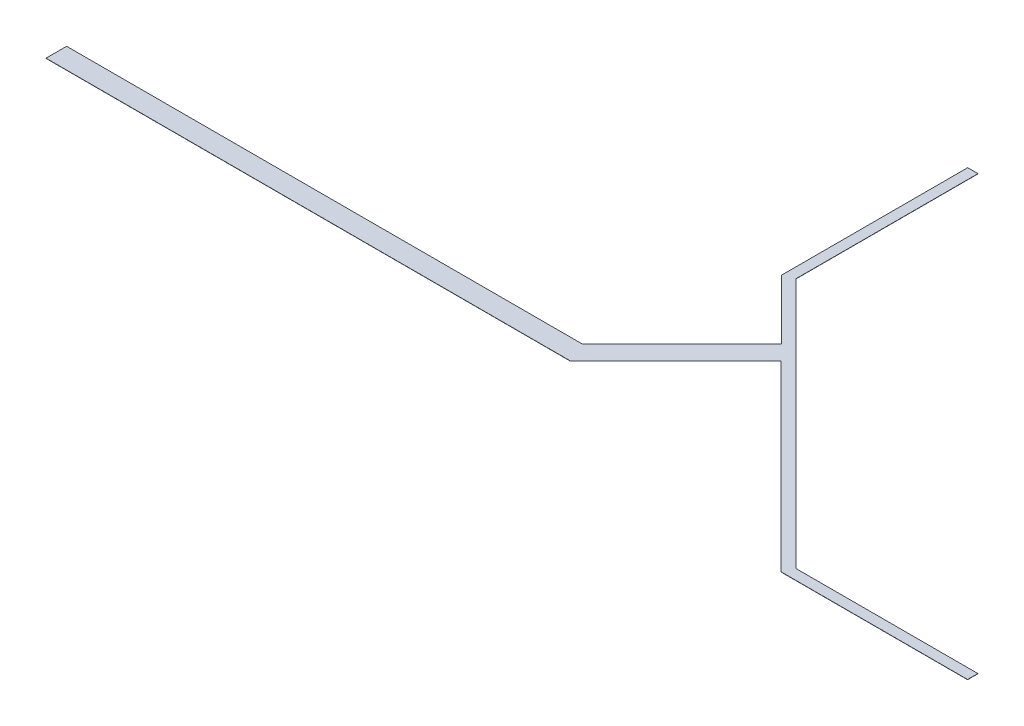
ISO-10303-21;
HEADER;
FILE_DESCRIPTION(('STEP AP214'),'2;1');
FILE_NAME('part.step','',(''),(''),'','','');
FILE_SCHEMA(('AUTOMOTIVE_DESIGN { 1 0 10303 214 1 1 1 1 }'));
ENDSEC;
DATA;
#1=APPLICATION_CONTEXT('core data for automotive mechanical design processes');
#2=APPLICATION_PROTOCOL_DEFINITION('international standard','automotive_design',2000,#1);
#3=PRODUCT_CONTEXT('',#1,'mechanical');
#4=PRODUCT('Part','Part','',(#3));
#5=PRODUCT_RELATED_PRODUCT_CATEGORY('part','',(#4));
#6=PRODUCT_DEFINITION_FORMATION('','',#4);
#7=PRODUCT_DEFINITION_CONTEXT('part definition',#1,'design');
#8=PRODUCT_DEFINITION('design','',#6,#7);
#9=PRODUCT_DEFINITION_SHAPE('','',#8);
#10=(LENGTH_UNIT() NAMED_UNIT(*) SI_UNIT(.MILLI.,.METRE.));
#11=(NAMED_UNIT(*) PLANE_ANGLE_UNIT() SI_UNIT($,.RADIAN.));
#12=(NAMED_UNIT(*) SI_UNIT($,.STERADIAN.) SOLID_ANGLE_UNIT());
#13=UNCERTAINTY_MEASURE_WITH_UNIT(LENGTH_MEASURE(1.E-05),#10,'distance_accuracy_value','');
#14=(GEOMETRIC_REPRESENTATION_CONTEXT(3) GLOBAL_UNCERTAINTY_ASSIGNED_CONTEXT((#13)) GLOBAL_UNIT_ASSIGNED_CONTEXT((#10,
#11,#12)) REPRESENTATION_CONTEXT('',''));
#15=CARTESIAN_POINT('',(0.,0.,0.));
#16=DIRECTION('',(0.,0.,1.));
#17=DIRECTION('',(1.,0.,0.));
#18=AXIS2_PLACEMENT_3D('',#15,#16,#17);
#19=CARTESIAN_POINT('',(0.,0.02,0.));
#20=DIRECTION('',(0.,0.,-1.));
#21=DIRECTION('',(-1.,0.,0.));
#22=AXIS2_PLACEMENT_3D('',#19,#20,#21);
#23=PLANE('',#22);
#24=DIRECTION('',(1.,0.,0.));
#25=VECTOR('',#24,1.);
#26=CARTESIAN_POINT('',(0.,0.,0.));
#27=LINE('',#26,#25);
#28=CARTESIAN_POINT('',(0.,0.,0.));
#29=VERTEX_POINT('',#28);
#30=CARTESIAN_POINT('',(50.83,0.,0.));
#31=VERTEX_POINT('',#30);
#32=EDGE_CURVE('E165',#29,#31,#27,.T.);
#33=ORIENTED_EDGE('',*,*,#32,.T.);
#34=DIRECTION('',(0.,-1.,0.));
#35=VECTOR('',#34,1.);
#36=CARTESIAN_POINT('',(50.83,0.02,0.));
#37=LINE('',#36,#35);
#38=CARTESIAN_POINT('',(50.83,0.02,0.));
#39=VERTEX_POINT('',#38);
#40=EDGE_CURVE('E11',#39,#31,#37,.T.);
#41=ORIENTED_EDGE('',*,*,#40,.F.);
#42=DIRECTION('',(1.,0.,0.));
#43=VECTOR('',#42,1.);
#44=CARTESIAN_POINT('',(0.,0.02,0.));
#45=LINE('',#44,#43);
#46=CARTESIAN_POINT('',(0.,0.02,0.));
#47=VERTEX_POINT('',#46);
#48=EDGE_CURVE('E191',#47,#39,#45,.T.);
#49=ORIENTED_EDGE('',*,*,#48,.F.);
#50=DIRECTION('',(0.,-1.,0.));
#51=VECTOR('',#50,1.);
#52=CARTESIAN_POINT('',(0.,0.02,0.));
#53=LINE('',#52,#51);
#54=EDGE_CURVE('E161',#47,#29,#53,.T.);
#55=ORIENTED_EDGE('',*,*,#54,.T.);
#56=EDGE_LOOP('',(#33,#41,#49,#55));
#57=FACE_BOUND('',#56,.T.);
#58=ADVANCED_FACE('F33',(#57),#23,.F.);
#59=CARTESIAN_POINT('',(50.83,0.02,0.));
#60=DIRECTION('',(-0.707106781186549,0.,-0.707106781186546));
#61=DIRECTION('',(-0.707106781186546,0.,0.707106781186549));
#62=AXIS2_PLACEMENT_3D('',#59,#60,#61);
#63=PLANE('',#62);
#64=DIRECTION('',(0.707106781186546,0.,-0.707106781186549));
#65=VECTOR('',#64,1.);
#66=CARTESIAN_POINT('',(50.83,0.,0.));
#67=LINE('',#66,#65);
#68=CARTESIAN_POINT('',(61.0618351237693,0.,-10.2318351237694));
#69=VERTEX_POINT('',#68);
#70=EDGE_CURVE('E168',#31,#69,#67,.T.);
#71=ORIENTED_EDGE('',*,*,#70,.T.);
#72=DIRECTION('',(0.,-1.,0.));
#73=VECTOR('',#72,1.);
#74=CARTESIAN_POINT('',(61.0618351237693,0.02,-10.2318351237694));
#75=LINE('',#74,#73);
#76=CARTESIAN_POINT('',(61.0618351237693,0.02,-10.2318351237694));
#77=VERTEX_POINT('',#76);
#78=EDGE_CURVE('E41',#77,#69,#75,.T.);
#79=ORIENTED_EDGE('',*,*,#78,.F.);
#80=DIRECTION('',(0.707106781186546,0.,-0.707106781186549));
#81=VECTOR('',#80,1.);
#82=CARTESIAN_POINT('',(50.83,0.02,0.));
#83=LINE('',#82,#81);
#84=EDGE_CURVE('E110',#39,#77,#83,.T.);
#85=ORIENTED_EDGE('',*,*,#84,.F.);
#86=ORIENTED_EDGE('',*,*,#40,.T.);
#87=EDGE_LOOP('',(#71,#79,#85,#86));
#88=FACE_BOUND('',#87,.T.);
#89=ADVANCED_FACE('F279',(#88),#63,.F.);
#90=CARTESIAN_POINT('',(61.0618351237693,0.02,-10.2318351237694));
#91=DIRECTION('',(0.707106781186548,0.,-0.707106781186547));
#92=DIRECTION('',(-0.707106781186547,0.,-0.707106781186548));
#93=AXIS2_PLACEMENT_3D('',#90,#91,#92);
#94=PLANE('',#93);
#95=DIRECTION('',(0.707106781186547,0.,0.707106781186548));
#96=VECTOR('',#95,1.);
#97=CARTESIAN_POINT('',(61.0618351237693,0.,-10.2318351237694));
#98=LINE('',#97,#96);
#99=CARTESIAN_POINT('',(78.7890021281161,0.,7.49533188057743));
#100=VERTEX_POINT('',#99);
#101=EDGE_CURVE('E170',#69,#100,#98,.T.);
#102=ORIENTED_EDGE('',*,*,#101,.T.);
#103=DIRECTION('',(0.,-1.,0.));
#104=VECTOR('',#103,1.);
#105=CARTESIAN_POINT('',(78.7890021281161,0.02,7.49533188057743));
#106=LINE('',#105,#104);
#107=CARTESIAN_POINT('',(78.7890021281161,0.02,7.49533188057743));
#108=VERTEX_POINT('',#107);
#109=EDGE_CURVE('E216',#108,#100,#106,.T.);
#110=ORIENTED_EDGE('',*,*,#109,.F.);
#111=DIRECTION('',(0.707106781186547,0.,0.707106781186548));
#112=VECTOR('',#111,1.);
#113=CARTESIAN_POINT('',(61.0618351237693,0.02,-10.2318351237694));
#114=LINE('',#113,#112);
#115=EDGE_CURVE('E224',#77,#108,#114,.T.);
#116=ORIENTED_EDGE('',*,*,#115,.F.);
#117=ORIENTED_EDGE('',*,*,#78,.T.);
#118=EDGE_LOOP('',(#102,#110,#116,#117));
#119=FACE_BOUND('',#118,.T.);
#120=ADVANCED_FACE('F222',(#119),#94,.F.);
#121=CARTESIAN_POINT('',(78.7890021281161,0.02,7.49533188057743));
#122=DIRECTION('',(0.,0.,-1.));
#123=DIRECTION('',(-1.,0.,0.));
#124=AXIS2_PLACEMENT_3D('',#121,#122,#123);
#125=PLANE('',#124);
#126=DIRECTION('',(1.,0.,0.));
#127=VECTOR('',#126,1.);
#128=CARTESIAN_POINT('',(78.7890021281161,0.,7.49533188057743));
#129=LINE('',#128,#127);
#130=CARTESIAN_POINT('',(96.8690021281161,0.,7.49533188057741));
#131=VERTEX_POINT('',#130);
#132=EDGE_CURVE('E172',#100,#131,#129,.T.);
#133=ORIENTED_EDGE('',*,*,#132,.T.);
#134=DIRECTION('',(0.,-1.,0.));
#135=VECTOR('',#134,1.);
#136=CARTESIAN_POINT('',(96.8690021281161,0.02,7.49533188057741));
#137=LINE('',#136,#135);
#138=CARTESIAN_POINT('',(96.8690021281161,0.02,7.49533188057741));
#139=VERTEX_POINT('',#138);
#140=EDGE_CURVE('E213',#139,#131,#137,.T.);
#141=ORIENTED_EDGE('',*,*,#140,.F.);
#142=DIRECTION('',(1.,0.,0.));
#143=VECTOR('',#142,1.);
#144=CARTESIAN_POINT('',(78.7890021281161,0.02,7.49533188057743));
#145=LINE('',#144,#143);
#146=EDGE_CURVE('E242',#108,#139,#145,.T.);
#147=ORIENTED_EDGE('',*,*,#146,.F.);
#148=ORIENTED_EDGE('',*,*,#109,.T.);
#149=EDGE_LOOP('',(#133,#141,#147,#148));
#150=FACE_BOUND('',#149,.T.);
#151=ADVANCED_FACE('F233',(#150),#125,.F.);
#152=CARTESIAN_POINT('',(96.8690021281161,0.02,7.49533188057741));
#153=DIRECTION('',(-1.,0.,0.));
#154=DIRECTION('',(0.,0.,1.));
#155=AXIS2_PLACEMENT_3D('',#152,#153,#154);
#156=PLANE('',#155);
#157=DIRECTION('',(0.,0.,-1.));
#158=VECTOR('',#157,1.);
#159=CARTESIAN_POINT('',(96.8690021281161,0.,7.49533188057741));
#160=LINE('',#159,#158);
#161=CARTESIAN_POINT('',(96.8690021281161,0.,6.49533188057741));
#162=VERTEX_POINT('',#161);
#163=EDGE_CURVE('E174',#131,#162,#160,.T.);
#164=ORIENTED_EDGE('',*,*,#163,.T.);
#165=DIRECTION('',(0.,-1.,0.));
#166=VECTOR('',#165,1.);
#167=CARTESIAN_POINT('',(96.8690021281161,0.02,6.49533188057741));
#168=LINE('',#167,#166);
#169=CARTESIAN_POINT('',(96.8690021281161,0.02,6.49533188057741));
#170=VERTEX_POINT('',#169);
#171=EDGE_CURVE('E210',#170,#162,#168,.T.);
#172=ORIENTED_EDGE('',*,*,#171,.F.);
#173=DIRECTION('',(0.,0.,-1.));
#174=VECTOR('',#173,1.);
#175=CARTESIAN_POINT('',(96.8690021281161,0.02,7.49533188057741));
#176=LINE('',#175,#174);
#177=EDGE_CURVE('E239',#139,#170,#176,.T.);
#178=ORIENTED_EDGE('',*,*,#177,.F.);
#179=ORIENTED_EDGE('',*,*,#140,.T.);
#180=EDGE_LOOP('',(#164,#172,#178,#179));
#181=FACE_BOUND('',#180,.T.);
#182=ADVANCED_FACE('F237',(#181),#156,.F.);
#183=CARTESIAN_POINT('',(96.8690021281161,0.02,6.49533188057741));
#184=DIRECTION('',(0.,0.,1.));
#185=DIRECTION('',(1.,0.,0.));
#186=AXIS2_PLACEMENT_3D('',#183,#184,#185);
#187=PLANE('',#186);
#188=DIRECTION('',(-1.,0.,0.));
#189=VECTOR('',#188,1.);
#190=CARTESIAN_POINT('',(96.8690021281161,0.,6.49533188057741));
#191=LINE('',#190,#189);
#192=CARTESIAN_POINT('',(79.2090021281161,0.,6.49533188057741));
#193=VERTEX_POINT('',#192);
#194=EDGE_CURVE('E176',#162,#193,#191,.T.);
#195=ORIENTED_EDGE('',*,*,#194,.T.);
#196=DIRECTION('',(0.,-1.,0.));
#197=VECTOR('',#196,1.);
#198=CARTESIAN_POINT('',(79.2090021281161,0.02,6.49533188057741));
#199=LINE('',#198,#197);
#200=CARTESIAN_POINT('',(79.2090021281161,0.02,6.49533188057741));
#201=VERTEX_POINT('',#200);
#202=EDGE_CURVE('E207',#201,#193,#199,.T.);
#203=ORIENTED_EDGE('',*,*,#202,.F.);
#204=DIRECTION('',(-1.,0.,0.));
#205=VECTOR('',#204,1.);
#206=CARTESIAN_POINT('',(96.8690021281161,0.02,6.49533188057741));
#207=LINE('',#206,#205);
#208=EDGE_CURVE('E241',#170,#201,#207,.T.);
#209=ORIENTED_EDGE('',*,*,#208,.F.);
#210=ORIENTED_EDGE('',*,*,#171,.T.);
#211=EDGE_LOOP('',(#195,#203,#209,#210));
#212=FACE_BOUND('',#211,.T.);
#213=ADVANCED_FACE('F292',(#212),#187,.F.);
#214=CARTESIAN_POINT('',(54.889087296526,0.02,-17.8349278298667));
#215=DIRECTION('',(-0.707257123013171,0.,0.70695640738813));
#216=DIRECTION('',(0.70695640738813,0.,0.707257123013171));
#217=AXIS2_PLACEMENT_3D('',#214,#215,#216);
#218=PLANE('',#217);
#219=DIRECTION('',(-0.70695640738813,0.,-0.707257123013171));
#220=VECTOR('',#219,1.);
#221=CARTESIAN_POINT('',(54.889087296526,0.,-17.8349278298667));
#222=LINE('',#221,#220);
#223=CARTESIAN_POINT('',(54.889087296526,0.,-17.8349278298667));
#224=VERTEX_POINT('',#223);
#225=EDGE_CURVE('E178',#193,#224,#222,.T.);
#226=ORIENTED_EDGE('',*,*,#225,.T.);
#227=DIRECTION('',(0.,-1.,0.));
#228=VECTOR('',#227,1.);
#229=CARTESIAN_POINT('',(54.889087296526,0.02,-17.8349278298667));
#230=LINE('',#229,#228);
#231=CARTESIAN_POINT('',(54.889087296526,0.02,-17.8349278298667));
#232=VERTEX_POINT('',#231);
#233=EDGE_CURVE('E204',#232,#224,#230,.T.);
#234=ORIENTED_EDGE('',*,*,#233,.F.);
#235=DIRECTION('',(-0.70695640738813,0.,-0.707257123013171));
#236=VECTOR('',#235,1.);
#237=CARTESIAN_POINT('',(54.889087296526,0.02,-17.8349278298667));
#238=LINE('',#237,#236);
#239=EDGE_CURVE('E244',#201,#232,#238,.T.);
#240=ORIENTED_EDGE('',*,*,#239,.F.);
#241=ORIENTED_EDGE('',*,*,#202,.T.);
#242=EDGE_LOOP('',(#226,#234,#240,#241));
#243=FACE_BOUND('',#242,.T.);
#244=ADVANCED_FACE('F295',(#243),#218,.F.);
#245=CARTESIAN_POINT('',(54.889087296526,0.02,-35.4949278298667));
#246=DIRECTION('',(-1.,0.,0.));
#247=DIRECTION('',(0.,0.,1.));
#248=AXIS2_PLACEMENT_3D('',#245,#246,#247);
#249=PLANE('',#248);
#250=DIRECTION('',(0.,0.,-1.));
#251=VECTOR('',#250,1.);
#252=CARTESIAN_POINT('',(54.889087296526,0.,-35.4949278298667));
#253=LINE('',#252,#251);
#254=CARTESIAN_POINT('',(54.889087296526,0.,-35.4949278298667));
#255=VERTEX_POINT('',#254);
#256=EDGE_CURVE('E180',#224,#255,#253,.T.);
#257=ORIENTED_EDGE('',*,*,#256,.T.);
#258=DIRECTION('',(0.,-1.,0.));
#259=VECTOR('',#258,1.);
#260=CARTESIAN_POINT('',(54.889087296526,0.02,-35.4949278298667));
#261=LINE('',#260,#259);
#262=CARTESIAN_POINT('',(54.889087296526,0.02,-35.4949278298667));
#263=VERTEX_POINT('',#262);
#264=EDGE_CURVE('E201',#263,#255,#261,.T.);
#265=ORIENTED_EDGE('',*,*,#264,.F.);
#266=DIRECTION('',(0.,0.,-1.));
#267=VECTOR('',#266,1.);
#268=CARTESIAN_POINT('',(54.889087296526,0.02,-35.4949278298667));
#269=LINE('',#268,#267);
#270=EDGE_CURVE('E250',#232,#263,#269,.T.);
#271=ORIENTED_EDGE('',*,*,#270,.F.);
#272=ORIENTED_EDGE('',*,*,#233,.T.);
#273=EDGE_LOOP('',(#257,#265,#271,#272));
#274=FACE_BOUND('',#273,.T.);
#275=ADVANCED_FACE('F299',(#274),#249,.F.);
#276=CARTESIAN_POINT('',(53.889087296526,0.02,-35.4949278298667));
#277=DIRECTION('',(0.,0.,1.));
#278=DIRECTION('',(1.,0.,0.));
#279=AXIS2_PLACEMENT_3D('',#276,#277,#278);
#280=PLANE('',#279);
#281=DIRECTION('',(-1.,0.,0.));
#282=VECTOR('',#281,1.);
#283=CARTESIAN_POINT('',(53.889087296526,0.,-35.4949278298667));
#284=LINE('',#283,#282);
#285=CARTESIAN_POINT('',(53.889087296526,0.,-35.4949278298667));
#286=VERTEX_POINT('',#285);
#287=EDGE_CURVE('E182',#255,#286,#284,.T.);
#288=ORIENTED_EDGE('',*,*,#287,.T.);
#289=DIRECTION('',(0.,-1.,0.));
#290=VECTOR('',#289,1.);
#291=CARTESIAN_POINT('',(53.889087296526,0.02,-35.4949278298667));
#292=LINE('',#291,#290);
#293=CARTESIAN_POINT('',(53.889087296526,0.02,-35.4949278298667));
#294=VERTEX_POINT('',#293);
#295=EDGE_CURVE('E198',#294,#286,#292,.T.);
#296=ORIENTED_EDGE('',*,*,#295,.F.);
#297=DIRECTION('',(-1.,0.,0.));
#298=VECTOR('',#297,1.);
#299=CARTESIAN_POINT('',(53.889087296526,0.02,-35.4949278298667));
#300=LINE('',#299,#298);
#301=EDGE_CURVE('E252',#263,#294,#300,.T.);
#302=ORIENTED_EDGE('',*,*,#301,.F.);
#303=ORIENTED_EDGE('',*,*,#264,.T.);
#304=EDGE_LOOP('',(#288,#296,#302,#303));
#305=FACE_BOUND('',#304,.T.);
#306=ADVANCED_FACE('F303',(#305),#280,.F.);
#307=CARTESIAN_POINT('',(53.889087296526,0.02,-17.4149278298667));
#308=DIRECTION('',(1.,0.,0.));
#309=DIRECTION('',(0.,0.,-1.));
#310=AXIS2_PLACEMENT_3D('',#307,#308,#309);
#311=PLANE('',#310);
#312=DIRECTION('',(0.,0.,1.));
#313=VECTOR('',#312,1.);
#314=CARTESIAN_POINT('',(53.889087296526,0.,-17.4149278298667));
#315=LINE('',#314,#313);
#316=CARTESIAN_POINT('',(53.889087296526,0.,-17.4149278298667));
#317=VERTEX_POINT('',#316);
#318=EDGE_CURVE('E184',#286,#317,#315,.T.);
#319=ORIENTED_EDGE('',*,*,#318,.T.);
#320=DIRECTION('',(0.,-1.,0.));
#321=VECTOR('',#320,1.);
#322=CARTESIAN_POINT('',(53.889087296526,0.02,-17.4149278298667));
#323=LINE('',#322,#321);
#324=CARTESIAN_POINT('',(53.889087296526,0.02,-17.4149278298667));
#325=VERTEX_POINT('',#324);
#326=EDGE_CURVE('E195',#325,#317,#323,.T.);
#327=ORIENTED_EDGE('',*,*,#326,.F.);
#328=DIRECTION('',(0.,0.,1.));
#329=VECTOR('',#328,1.);
#330=CARTESIAN_POINT('',(53.889087296526,0.02,-17.4149278298667));
#331=LINE('',#330,#329);
#332=EDGE_CURVE('E254',#294,#325,#331,.T.);
#333=ORIENTED_EDGE('',*,*,#332,.F.);
#334=ORIENTED_EDGE('',*,*,#295,.T.);
#335=EDGE_LOOP('',(#319,#327,#333,#334));
#336=FACE_BOUND('',#335,.T.);
#337=ADVANCED_FACE('F260',(#336),#311,.F.);
#338=CARTESIAN_POINT('',(59.6520075631964,0.02,-11.6520075631964));
#339=DIRECTION('',(0.707106781186548,0.,-0.707106781186547));
#340=DIRECTION('',(-0.707106781186547,0.,-0.707106781186548));
#341=AXIS2_PLACEMENT_3D('',#338,#339,#340);
#342=PLANE('',#341);
#343=DIRECTION('',(0.707106781186547,0.,0.707106781186548));
#344=VECTOR('',#343,1.);
#345=CARTESIAN_POINT('',(59.6520075631964,0.,-11.6520075631964));
#346=LINE('',#345,#344);
#347=CARTESIAN_POINT('',(59.6520075631964,0.,-11.6520075631964));
#348=VERTEX_POINT('',#347);
#349=EDGE_CURVE('E186',#317,#348,#346,.T.);
#350=ORIENTED_EDGE('',*,*,#349,.T.);
#351=DIRECTION('',(0.,-1.,0.));
#352=VECTOR('',#351,1.);
#353=CARTESIAN_POINT('',(59.6520075631964,0.02,-11.6520075631964));
#354=LINE('',#353,#352);
#355=CARTESIAN_POINT('',(59.6520075631964,0.02,-11.6520075631964));
#356=VERTEX_POINT('',#355);
#357=EDGE_CURVE('E156',#356,#348,#354,.T.);
#358=ORIENTED_EDGE('',*,*,#357,.F.);
#359=DIRECTION('',(0.707106781186547,0.,0.707106781186548));
#360=VECTOR('',#359,1.);
#361=CARTESIAN_POINT('',(59.6520075631964,0.02,-11.6520075631964));
#362=LINE('',#361,#360);
#363=EDGE_CURVE('E147',#325,#356,#362,.T.);
#364=ORIENTED_EDGE('',*,*,#363,.F.);
#365=ORIENTED_EDGE('',*,*,#326,.T.);
#366=EDGE_LOOP('',(#350,#358,#364,#365));
#367=FACE_BOUND('',#366,.T.);
#368=ADVANCED_FACE('F264',(#367),#342,.F.);
#369=CARTESIAN_POINT('',(50.,0.02,-2.));
#370=DIRECTION('',(0.707106781186549,0.,0.707106781186546));
#371=DIRECTION('',(0.707106781186546,0.,-0.707106781186549));
#372=AXIS2_PLACEMENT_3D('',#369,#370,#371);
#373=PLANE('',#372);
#374=DIRECTION('',(-0.707106781186546,0.,0.707106781186549));
#375=VECTOR('',#374,1.);
#376=CARTESIAN_POINT('',(50.,0.,-2.));
#377=LINE('',#376,#375);
#378=CARTESIAN_POINT('',(50.,0.,-2.));
#379=VERTEX_POINT('',#378);
#380=EDGE_CURVE('E155',#348,#379,#377,.T.);
#381=ORIENTED_EDGE('',*,*,#380,.T.);
#382=DIRECTION('',(0.,-1.,0.));
#383=VECTOR('',#382,1.);
#384=CARTESIAN_POINT('',(50.,0.02,-2.));
#385=LINE('',#384,#383);
#386=CARTESIAN_POINT('',(50.,0.02,-2.));
#387=VERTEX_POINT('',#386);
#388=EDGE_CURVE('E152',#387,#379,#385,.T.);
#389=ORIENTED_EDGE('',*,*,#388,.F.);
#390=DIRECTION('',(-0.707106781186546,0.,0.707106781186549));
#391=VECTOR('',#390,1.);
#392=CARTESIAN_POINT('',(50.,0.02,-2.));
#393=LINE('',#392,#391);
#394=EDGE_CURVE('E141',#356,#387,#393,.T.);
#395=ORIENTED_EDGE('',*,*,#394,.F.);
#396=ORIENTED_EDGE('',*,*,#357,.T.);
#397=EDGE_LOOP('',(#381,#389,#395,#396));
#398=FACE_BOUND('',#397,.T.);
#399=ADVANCED_FACE('F153',(#398),#373,.F.);
#400=CARTESIAN_POINT('',(0.,0.02,-2.));
#401=DIRECTION('',(0.,0.,1.));
#402=DIRECTION('',(1.,0.,0.));
#403=AXIS2_PLACEMENT_3D('',#400,#401,#402);
#404=PLANE('',#403);
#405=DIRECTION('',(-1.,0.,0.));
#406=VECTOR('',#405,1.);
#407=CARTESIAN_POINT('',(0.,0.,-2.));
#408=LINE('',#407,#406);
#409=CARTESIAN_POINT('',(0.,0.,-2.));
#410=VERTEX_POINT('',#409);
#411=EDGE_CURVE('E96',#379,#410,#408,.T.);
#412=ORIENTED_EDGE('',*,*,#411,.T.);
#413=DIRECTION('',(0.,-1.,0.));
#414=VECTOR('',#413,1.);
#415=CARTESIAN_POINT('',(0.,0.02,-2.));
#416=LINE('',#415,#414);
#417=CARTESIAN_POINT('',(0.,0.02,-2.));
#418=VERTEX_POINT('',#417);
#419=EDGE_CURVE('E157',#418,#410,#416,.T.);
#420=ORIENTED_EDGE('',*,*,#419,.F.);
#421=DIRECTION('',(-1.,0.,0.));
#422=VECTOR('',#421,1.);
#423=CARTESIAN_POINT('',(0.,0.02,-2.));
#424=LINE('',#423,#422);
#425=EDGE_CURVE('E145',#387,#418,#424,.T.);
#426=ORIENTED_EDGE('',*,*,#425,.F.);
#427=ORIENTED_EDGE('',*,*,#388,.T.);
#428=EDGE_LOOP('',(#412,#420,#426,#427));
#429=FACE_BOUND('',#428,.T.);
#430=ADVANCED_FACE('F159',(#429),#404,.F.);
#431=CARTESIAN_POINT('',(0.,0.02,0.));
#432=DIRECTION('',(1.,0.,0.));
#433=DIRECTION('',(0.,0.,-1.));
#434=AXIS2_PLACEMENT_3D('',#431,#432,#433);
#435=PLANE('',#434);
#436=DIRECTION('',(0.,0.,1.));
#437=VECTOR('',#436,1.);
#438=CARTESIAN_POINT('',(0.,0.,0.));
#439=LINE('',#438,#437);
#440=EDGE_CURVE('E102',#410,#29,#439,.T.);
#441=ORIENTED_EDGE('',*,*,#440,.T.);
#442=ORIENTED_EDGE('',*,*,#54,.F.);
#443=DIRECTION('',(0.,0.,1.));
#444=VECTOR('',#443,1.);
#445=CARTESIAN_POINT('',(0.,0.02,0.));
#446=LINE('',#445,#444);
#447=EDGE_CURVE('E49',#418,#47,#446,.T.);
#448=ORIENTED_EDGE('',*,*,#447,.F.);
#449=ORIENTED_EDGE('',*,*,#419,.T.);
#450=EDGE_LOOP('',(#441,#442,#448,#449));
#451=FACE_BOUND('',#450,.T.);
#452=ADVANCED_FACE('F268',(#451),#435,.F.);
#453=CARTESIAN_POINT('',(0.,0.02,0.));
#454=DIRECTION('',(0.,1.,0.));
#455=DIRECTION('',(0.,0.,1.));
#456=AXIS2_PLACEMENT_3D('',#453,#454,#455);
#457=PLANE('',#456);
#458=ORIENTED_EDGE('',*,*,#48,.T.);
#459=ORIENTED_EDGE('',*,*,#84,.T.);
#460=ORIENTED_EDGE('',*,*,#115,.T.);
#461=ORIENTED_EDGE('',*,*,#146,.T.);
#462=ORIENTED_EDGE('',*,*,#177,.T.);
#463=ORIENTED_EDGE('',*,*,#208,.T.);
#464=ORIENTED_EDGE('',*,*,#239,.T.);
#465=ORIENTED_EDGE('',*,*,#270,.T.);
#466=ORIENTED_EDGE('',*,*,#301,.T.);
#467=ORIENTED_EDGE('',*,*,#332,.T.);
#468=ORIENTED_EDGE('',*,*,#363,.T.);
#469=ORIENTED_EDGE('',*,*,#394,.T.);
#470=ORIENTED_EDGE('',*,*,#425,.T.);
#471=ORIENTED_EDGE('',*,*,#447,.T.);
#472=EDGE_LOOP('',(#458,#459,#460,#461,#462,#463,#464,#465,#466,#467,#468,#469,#470,#471));
#473=FACE_BOUND('',#472,.T.);
#474=ADVANCED_FACE('F143',(#473),#457,.T.);
#475=CARTESIAN_POINT('',(0.,0.,0.));
#476=DIRECTION('',(0.,1.,0.));
#477=DIRECTION('',(0.,0.,1.));
#478=AXIS2_PLACEMENT_3D('',#475,#476,#477);
#479=PLANE('',#478);
#480=ORIENTED_EDGE('',*,*,#32,.F.);
#481=ORIENTED_EDGE('',*,*,#440,.F.);
#482=ORIENTED_EDGE('',*,*,#411,.F.);
#483=ORIENTED_EDGE('',*,*,#380,.F.);
#484=ORIENTED_EDGE('',*,*,#349,.F.);
#485=ORIENTED_EDGE('',*,*,#318,.F.);
#486=ORIENTED_EDGE('',*,*,#287,.F.);
#487=ORIENTED_EDGE('',*,*,#256,.F.);
#488=ORIENTED_EDGE('',*,*,#225,.F.);
#489=ORIENTED_EDGE('',*,*,#194,.F.);
#490=ORIENTED_EDGE('',*,*,#163,.F.);
#491=ORIENTED_EDGE('',*,*,#132,.F.);
#492=ORIENTED_EDGE('',*,*,#101,.F.);
#493=ORIENTED_EDGE('',*,*,#70,.F.);
#494=EDGE_LOOP('',(#480,#481,#482,#483,#484,#485,#486,#487,#488,#489,#490,#491,#492,#493));
#495=FACE_BOUND('',#494,.T.);
#496=ADVANCED_FACE('F228',(#495),#479,.F.);
#497=CLOSED_SHELL('',(#58,#89,#120,#151,#182,#213,#244,#275,#306,#337,#368,#399,#430,#452,#474,#496));
#498=MANIFOLD_SOLID_BREP('B2',#497);
#499=ADVANCED_BREP_SHAPE_REPRESENTATION('',(#18,#498),#14);
#500=SHAPE_DEFINITION_REPRESENTATION(#9,#499);
ENDSEC;
END-ISO-10303-21;
